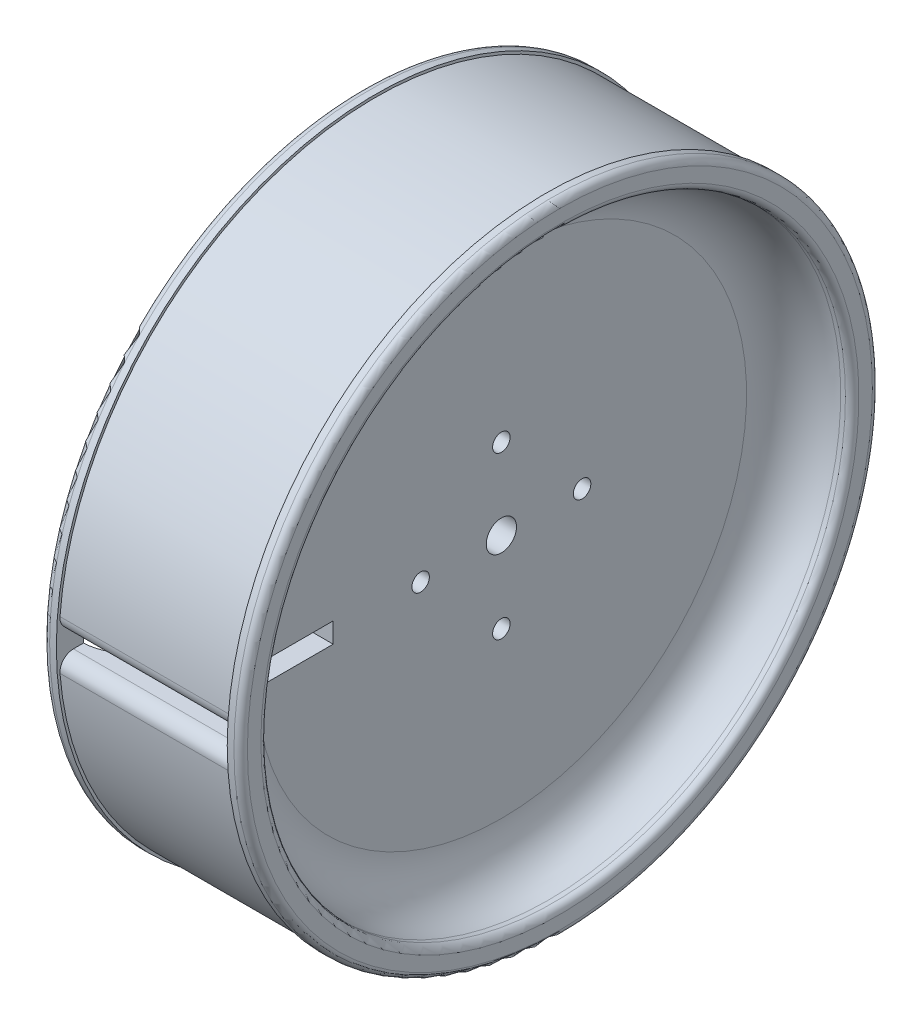
ISO-10303-21;
HEADER;
FILE_DESCRIPTION(('STEP AP214'),'2;1');
FILE_NAME('part.step','',(''),(''),'','','');
FILE_SCHEMA(('AUTOMOTIVE_DESIGN { 1 0 10303 214 1 1 1 1 }'));
ENDSEC;
DATA;
#1=APPLICATION_CONTEXT('core data for automotive mechanical design processes');
#2=APPLICATION_PROTOCOL_DEFINITION('international standard','automotive_design',2000,#1);
#3=PRODUCT_CONTEXT('',#1,'mechanical');
#4=PRODUCT('Part','Part','',(#3));
#5=PRODUCT_RELATED_PRODUCT_CATEGORY('part','',(#4));
#6=PRODUCT_DEFINITION_FORMATION('','',#4);
#7=PRODUCT_DEFINITION_CONTEXT('part definition',#1,'design');
#8=PRODUCT_DEFINITION('design','',#6,#7);
#9=PRODUCT_DEFINITION_SHAPE('','',#8);
#10=(LENGTH_UNIT() NAMED_UNIT(*) SI_UNIT(.MILLI.,.METRE.));
#11=(NAMED_UNIT(*) PLANE_ANGLE_UNIT() SI_UNIT($,.RADIAN.));
#12=(NAMED_UNIT(*) SI_UNIT($,.STERADIAN.) SOLID_ANGLE_UNIT());
#13=UNCERTAINTY_MEASURE_WITH_UNIT(LENGTH_MEASURE(1.E-05),#10,'distance_accuracy_value','');
#14=(GEOMETRIC_REPRESENTATION_CONTEXT(3) GLOBAL_UNCERTAINTY_ASSIGNED_CONTEXT((#13)) GLOBAL_UNIT_ASSIGNED_CONTEXT((#10,
#11,#12)) REPRESENTATION_CONTEXT('',''));
#15=CARTESIAN_POINT('',(0.,0.,0.));
#16=DIRECTION('',(0.,0.,1.));
#17=DIRECTION('',(1.,0.,0.));
#18=AXIS2_PLACEMENT_3D('',#15,#16,#17);
#19=CARTESIAN_POINT('',(6.,0.,0.));
#20=DIRECTION('',(-1.,0.,0.));
#21=DIRECTION('',(0.,0.,1.));
#22=AXIS2_PLACEMENT_3D('',#19,#20,#21);
#23=PLANE('',#22);
#24=CARTESIAN_POINT('',(6.,0.,0.));
#25=DIRECTION('',(1.,0.,0.));
#26=DIRECTION('',(0.,0.,-1.));
#27=AXIS2_PLACEMENT_3D('',#24,#25,#26);
#28=CIRCLE('',#27,2.25);
#29=CARTESIAN_POINT('',(6.,0.,-2.25));
#30=VERTEX_POINT('',#29);
#31=EDGE_CURVE('E218',#30,#30,#28,.T.);
#32=ORIENTED_EDGE('',*,*,#31,.F.);
#33=EDGE_LOOP('',(#32));
#34=FACE_BOUND('',#33,.T.);
#35=CARTESIAN_POINT('',(6.,0.,-12.));
#36=DIRECTION('',(1.,0.,0.));
#37=DIRECTION('',(0.,0.,-1.));
#38=AXIS2_PLACEMENT_3D('',#35,#36,#37);
#39=CIRCLE('',#38,1.3);
#40=CARTESIAN_POINT('',(6.,0.,-13.3));
#41=VERTEX_POINT('',#40);
#42=EDGE_CURVE('E198',#41,#41,#39,.T.);
#43=ORIENTED_EDGE('',*,*,#42,.F.);
#44=EDGE_LOOP('',(#43));
#45=FACE_BOUND('',#44,.T.);
#46=CARTESIAN_POINT('',(6.,-12.,0.));
#47=DIRECTION('',(1.,0.,0.));
#48=DIRECTION('',(0.,0.,-1.));
#49=AXIS2_PLACEMENT_3D('',#46,#47,#48);
#50=CIRCLE('',#49,1.3);
#51=CARTESIAN_POINT('',(6.,-12.,-1.3));
#52=VERTEX_POINT('',#51);
#53=EDGE_CURVE('E197',#52,#52,#50,.T.);
#54=ORIENTED_EDGE('',*,*,#53,.F.);
#55=EDGE_LOOP('',(#54));
#56=FACE_BOUND('',#55,.T.);
#57=CARTESIAN_POINT('',(6.,0.,12.));
#58=DIRECTION('',(1.,0.,0.));
#59=DIRECTION('',(0.,0.,-1.));
#60=AXIS2_PLACEMENT_3D('',#57,#58,#59);
#61=CIRCLE('',#60,1.3);
#62=CARTESIAN_POINT('',(6.,0.,10.7));
#63=VERTEX_POINT('',#62);
#64=EDGE_CURVE('E214',#63,#63,#61,.T.);
#65=ORIENTED_EDGE('',*,*,#64,.F.);
#66=EDGE_LOOP('',(#65));
#67=FACE_BOUND('',#66,.T.);
#68=CARTESIAN_POINT('',(6.,12.,0.));
#69=DIRECTION('',(1.,0.,0.));
#70=DIRECTION('',(0.,0.,-1.));
#71=AXIS2_PLACEMENT_3D('',#68,#69,#70);
#72=CIRCLE('',#71,1.3);
#73=CARTESIAN_POINT('',(6.,12.,-1.3));
#74=VERTEX_POINT('',#73);
#75=EDGE_CURVE('E213',#74,#74,#72,.T.);
#76=ORIENTED_EDGE('',*,*,#75,.F.);
#77=EDGE_LOOP('',(#76));
#78=FACE_BOUND('',#77,.T.);
#79=DIRECTION('',(0.,0.,-1.));
#80=VECTOR('',#79,1.);
#81=CARTESIAN_POINT('',(6.,-1.5,0.));
#82=LINE('',#81,#80);
#83=CARTESIAN_POINT('',(6.,-1.5,36.4191227241953));
#84=VERTEX_POINT('',#83);
#85=CARTESIAN_POINT('',(6.,-1.5,25.));
#86=VERTEX_POINT('',#85);
#87=EDGE_CURVE('E163',#84,#86,#82,.T.);
#88=ORIENTED_EDGE('',*,*,#87,.F.);
#89=CARTESIAN_POINT('',(6.,0.,0.));
#90=DIRECTION('',(-1.,0.,0.));
#91=DIRECTION('',(0.,0.,1.));
#92=AXIS2_PLACEMENT_3D('',#89,#90,#91);
#93=CIRCLE('',#92,36.45);
#94=CARTESIAN_POINT('',(6.,1.5,36.4191227241953));
#95=VERTEX_POINT('',#94);
#96=EDGE_CURVE('E315',#84,#95,#93,.F.);
#97=ORIENTED_EDGE('',*,*,#96,.T.);
#98=DIRECTION('',(0.,0.,1.));
#99=VECTOR('',#98,1.);
#100=CARTESIAN_POINT('',(6.,1.5,0.));
#101=LINE('',#100,#99);
#102=CARTESIAN_POINT('',(6.,1.5,25.));
#103=VERTEX_POINT('',#102);
#104=EDGE_CURVE('E172',#103,#95,#101,.T.);
#105=ORIENTED_EDGE('',*,*,#104,.F.);
#106=DIRECTION('',(0.,-1.,0.));
#107=VECTOR('',#106,1.);
#108=CARTESIAN_POINT('',(6.,0.,25.));
#109=LINE('',#108,#107);
#110=EDGE_CURVE('E189',#103,#86,#109,.T.);
#111=ORIENTED_EDGE('',*,*,#110,.T.);
#112=EDGE_LOOP('',(#88,#97,#105,#111));
#113=FACE_BOUND('',#112,.T.);
#114=ADVANCED_FACE('F47',(#34,#45,#56,#67,#78,#113),#23,.F.);
#115=CARTESIAN_POINT('',(-6.,0.,-43.45));
#116=DIRECTION('',(1.,0.,0.));
#117=DIRECTION('',(0.,0.,-1.));
#118=AXIS2_PLACEMENT_3D('',#115,#116,#117);
#119=PLANE('',#118);
#120=CARTESIAN_POINT('',(-6.,0.,0.));
#121=DIRECTION('',(1.,0.,0.));
#122=DIRECTION('',(0.,0.,-1.));
#123=AXIS2_PLACEMENT_3D('',#120,#121,#122);
#124=CIRCLE('',#123,2.25);
#125=CARTESIAN_POINT('',(-6.,0.,-2.25));
#126=VERTEX_POINT('',#125);
#127=EDGE_CURVE('E228',#126,#126,#124,.F.);
#128=ORIENTED_EDGE('',*,*,#127,.F.);
#129=EDGE_LOOP('',(#128));
#130=FACE_BOUND('',#129,.T.);
#131=CARTESIAN_POINT('',(-6.,0.,-12.));
#132=DIRECTION('',(1.,0.,0.));
#133=DIRECTION('',(0.,0.,-1.));
#134=AXIS2_PLACEMENT_3D('',#131,#132,#133);
#135=CIRCLE('',#134,1.3);
#136=CARTESIAN_POINT('',(-6.,0.,-13.3));
#137=VERTEX_POINT('',#136);
#138=EDGE_CURVE('E192',#137,#137,#135,.F.);
#139=ORIENTED_EDGE('',*,*,#138,.F.);
#140=EDGE_LOOP('',(#139));
#141=FACE_BOUND('',#140,.T.);
#142=CARTESIAN_POINT('',(-6.,-12.,0.));
#143=DIRECTION('',(1.,0.,0.));
#144=DIRECTION('',(0.,0.,-1.));
#145=AXIS2_PLACEMENT_3D('',#142,#143,#144);
#146=CIRCLE('',#145,1.3);
#147=CARTESIAN_POINT('',(-6.,-12.,-1.3));
#148=VERTEX_POINT('',#147);
#149=EDGE_CURVE('E193',#148,#148,#146,.F.);
#150=ORIENTED_EDGE('',*,*,#149,.F.);
#151=EDGE_LOOP('',(#150));
#152=FACE_BOUND('',#151,.T.);
#153=CARTESIAN_POINT('',(-6.,0.,12.));
#154=DIRECTION('',(1.,0.,0.));
#155=DIRECTION('',(0.,0.,-1.));
#156=AXIS2_PLACEMENT_3D('',#153,#154,#155);
#157=CIRCLE('',#156,1.3);
#158=CARTESIAN_POINT('',(-6.,0.,10.7));
#159=VERTEX_POINT('',#158);
#160=EDGE_CURVE('E202',#159,#159,#157,.F.);
#161=ORIENTED_EDGE('',*,*,#160,.F.);
#162=EDGE_LOOP('',(#161));
#163=FACE_BOUND('',#162,.T.);
#164=CARTESIAN_POINT('',(-6.,12.,0.));
#165=DIRECTION('',(1.,0.,0.));
#166=DIRECTION('',(0.,0.,-1.));
#167=AXIS2_PLACEMENT_3D('',#164,#165,#166);
#168=CIRCLE('',#167,1.3);
#169=CARTESIAN_POINT('',(-6.,12.,-1.3));
#170=VERTEX_POINT('',#169);
#171=EDGE_CURVE('E209',#170,#170,#168,.F.);
#172=ORIENTED_EDGE('',*,*,#171,.F.);
#173=EDGE_LOOP('',(#172));
#174=FACE_BOUND('',#173,.T.);
#175=DIRECTION('',(0.,0.,-1.));
#176=VECTOR('',#175,1.);
#177=CARTESIAN_POINT('',(-6.,1.5,-43.45));
#178=LINE('',#177,#176);
#179=CARTESIAN_POINT('',(-6.,1.5,36.4191227241953));
#180=VERTEX_POINT('',#179);
#181=CARTESIAN_POINT('',(-6.,1.5,25.));
#182=VERTEX_POINT('',#181);
#183=EDGE_CURVE('E177',#180,#182,#178,.T.);
#184=ORIENTED_EDGE('',*,*,#183,.F.);
#185=CARTESIAN_POINT('',(-6.,0.,0.));
#186=DIRECTION('',(1.,0.,0.));
#187=DIRECTION('',(0.,0.,-1.));
#188=AXIS2_PLACEMENT_3D('',#185,#186,#187);
#189=CIRCLE('',#188,36.45);
#190=CARTESIAN_POINT('',(-6.,-1.5,36.4191227241953));
#191=VERTEX_POINT('',#190);
#192=EDGE_CURVE('E170',#180,#191,#189,.F.);
#193=ORIENTED_EDGE('',*,*,#192,.T.);
#194=DIRECTION('',(0.,0.,1.));
#195=VECTOR('',#194,1.);
#196=CARTESIAN_POINT('',(-6.,-1.5,-43.45));
#197=LINE('',#196,#195);
#198=CARTESIAN_POINT('',(-6.,-1.5,25.));
#199=VERTEX_POINT('',#198);
#200=EDGE_CURVE('E161',#199,#191,#197,.T.);
#201=ORIENTED_EDGE('',*,*,#200,.F.);
#202=DIRECTION('',(0.,1.,0.));
#203=VECTOR('',#202,1.);
#204=CARTESIAN_POINT('',(-6.,0.,25.));
#205=LINE('',#204,#203);
#206=EDGE_CURVE('E143',#199,#182,#205,.T.);
#207=ORIENTED_EDGE('',*,*,#206,.T.);
#208=EDGE_LOOP('',(#184,#193,#201,#207));
#209=FACE_BOUND('',#208,.T.);
#210=ADVANCED_FACE('F168',(#130,#141,#152,#163,#174,#209),#119,.F.);
#211=CARTESIAN_POINT('',(-6.,0.,0.));
#212=DIRECTION('',(-1.,0.,0.));
#213=DIRECTION('',(0.,0.,1.));
#214=AXIS2_PLACEMENT_3D('',#211,#212,#213);
#215=CYLINDRICAL_SURFACE('',#214,43.45);
#216=CARTESIAN_POINT('',(-13.7,0.,0.));
#217=DIRECTION('',(1.,0.,0.));
#218=DIRECTION('',(0.,0.,-1.));
#219=AXIS2_PLACEMENT_3D('',#216,#217,#218);
#220=CIRCLE('',#219,43.45);
#221=CARTESIAN_POINT('',(-13.7,0.,-43.45));
#222=VERTEX_POINT('',#221);
#223=EDGE_CURVE('E262',#222,#222,#220,.F.);
#224=ORIENTED_EDGE('',*,*,#223,.T.);
#225=EDGE_LOOP('',(#224));
#226=FACE_BOUND('',#225,.T.);
#227=CARTESIAN_POINT('',(-12.7,0.,0.));
#228=DIRECTION('',(1.,0.,0.));
#229=DIRECTION('',(0.,0.,-1.));
#230=AXIS2_PLACEMENT_3D('',#227,#228,#229);
#231=CIRCLE('',#230,43.45);
#232=CARTESIAN_POINT('',(-12.7,-1.5,43.4241004512471));
#233=VERTEX_POINT('',#232);
#234=CARTESIAN_POINT('',(-12.7,1.5,43.4241004512471));
#235=VERTEX_POINT('',#234);
#236=EDGE_CURVE('E185',#233,#235,#231,.F.);
#237=ORIENTED_EDGE('',*,*,#236,.F.);
#238=DIRECTION('',(-1.,0.,0.));
#239=VECTOR('',#238,1.);
#240=CARTESIAN_POINT('',(-6.,-1.5,43.4241004512471));
#241=LINE('',#240,#239);
#242=CARTESIAN_POINT('',(-13.,-1.5,43.4241004512471));
#243=VERTEX_POINT('',#242);
#244=EDGE_CURVE('E295',#233,#243,#241,.T.);
#245=ORIENTED_EDGE('',*,*,#244,.T.);
#246=CARTESIAN_POINT('',(-13.,0.,0.));
#247=DIRECTION('',(1.,0.,0.));
#248=DIRECTION('',(0.,0.,-1.));
#249=AXIS2_PLACEMENT_3D('',#246,#247,#248);
#250=CIRCLE('',#249,43.45);
#251=CARTESIAN_POINT('',(-13.,1.7880658436214,43.4131929318597));
#252=VERTEX_POINT('',#251);
#253=EDGE_CURVE('E292',#243,#252,#250,.T.);
#254=ORIENTED_EDGE('',*,*,#253,.T.);
#255=CARTESIAN_POINT('',(-13.,0.,0.));
#256=DIRECTION('',(1.,0.,0.));
#257=DIRECTION('',(0.,0.,-1.));
#258=AXIS2_PLACEMENT_3D('',#255,#256,#257);
#259=CIRCLE('',#258,43.45);
#260=CARTESIAN_POINT('',(-13.,1.5,43.4241004512471));
#261=VERTEX_POINT('',#260);
#262=EDGE_CURVE('E288',#252,#261,#259,.T.);
#263=ORIENTED_EDGE('',*,*,#262,.T.);
#264=DIRECTION('',(-1.,0.,0.));
#265=VECTOR('',#264,1.);
#266=CARTESIAN_POINT('',(-6.,1.5,43.4241004512471));
#267=LINE('',#266,#265);
#268=EDGE_CURVE('E284',#261,#235,#267,.F.);
#269=ORIENTED_EDGE('',*,*,#268,.T.);
#270=EDGE_LOOP('',(#237,#245,#254,#263,#269));
#271=FACE_BOUND('',#270,.T.);
#272=ADVANCED_FACE('F378',(#226,#271),#215,.F.);
#273=CARTESIAN_POINT('',(-6.,0.,0.));
#274=DIRECTION('',(-1.,0.,0.));
#275=DIRECTION('',(0.,0.,1.));
#276=AXIS2_PLACEMENT_3D('',#273,#274,#275);
#277=CYLINDRICAL_SURFACE('',#276,47.05);
#278=CARTESIAN_POINT('',(12.7,0.,0.));
#279=DIRECTION('',(-1.,0.,0.));
#280=DIRECTION('',(0.,0.,1.));
#281=AXIS2_PLACEMENT_3D('',#278,#279,#280);
#282=CIRCLE('',#281,47.05);
#283=CARTESIAN_POINT('',(12.7,3.65538290788013,46.9077890738497));
#284=VERTEX_POINT('',#283);
#285=CARTESIAN_POINT('',(12.7,-3.65538290788013,46.9077890738497));
#286=VERTEX_POINT('',#285);
#287=EDGE_CURVE('E236',#284,#286,#282,.T.);
#288=ORIENTED_EDGE('',*,*,#287,.T.);
#289=DIRECTION('',(-1.,0.,0.));
#290=VECTOR('',#289,1.);
#291=CARTESIAN_POINT('',(-6.,-3.65538290788013,46.9077890738497));
#292=LINE('',#291,#290);
#293=CARTESIAN_POINT('',(-12.7,-3.65538290788013,46.9077890738497));
#294=VERTEX_POINT('',#293);
#295=EDGE_CURVE('E465',#286,#294,#292,.T.);
#296=ORIENTED_EDGE('',*,*,#295,.T.);
#297=CARTESIAN_POINT('',(-12.7,0.,0.));
#298=DIRECTION('',(-1.,0.,0.));
#299=DIRECTION('',(0.,0.,1.));
#300=AXIS2_PLACEMENT_3D('',#297,#298,#299);
#301=CIRCLE('',#300,47.05);
#302=CARTESIAN_POINT('',(-12.7,3.65538290788013,46.9077890738497));
#303=VERTEX_POINT('',#302);
#304=EDGE_CURVE('E240',#303,#294,#301,.T.);
#305=ORIENTED_EDGE('',*,*,#304,.F.);
#306=DIRECTION('',(-1.,0.,0.));
#307=VECTOR('',#306,1.);
#308=CARTESIAN_POINT('',(-6.,3.65538290788013,46.9077890738497));
#309=LINE('',#308,#307);
#310=EDGE_CURVE('E463',#303,#284,#309,.F.);
#311=ORIENTED_EDGE('',*,*,#310,.T.);
#312=EDGE_LOOP('',(#288,#296,#305,#311));
#313=FACE_BOUND('',#312,.T.);
#314=ADVANCED_FACE('F425',(#313),#277,.T.);
#315=CARTESIAN_POINT('',(-6.,0.,0.));
#316=DIRECTION('',(-1.,0.,0.));
#317=DIRECTION('',(0.,0.,1.));
#318=AXIS2_PLACEMENT_3D('',#315,#316,#317);
#319=CYLINDRICAL_SURFACE('',#318,43.45);
#320=CARTESIAN_POINT('',(13.7,0.,0.));
#321=DIRECTION('',(-1.,0.,0.));
#322=DIRECTION('',(0.,0.,1.));
#323=AXIS2_PLACEMENT_3D('',#320,#321,#322);
#324=CIRCLE('',#323,43.45);
#325=CARTESIAN_POINT('',(13.7,0.,43.45));
#326=VERTEX_POINT('',#325);
#327=EDGE_CURVE('E274',#326,#326,#324,.F.);
#328=ORIENTED_EDGE('',*,*,#327,.T.);
#329=EDGE_LOOP('',(#328));
#330=FACE_BOUND('',#329,.T.);
#331=CARTESIAN_POINT('',(13.,0.,0.));
#332=DIRECTION('',(-1.,0.,0.));
#333=DIRECTION('',(0.,0.,1.));
#334=AXIS2_PLACEMENT_3D('',#331,#332,#333);
#335=CIRCLE('',#334,43.45);
#336=CARTESIAN_POINT('',(13.,1.78806584362144,43.4131929318597));
#337=VERTEX_POINT('',#336);
#338=CARTESIAN_POINT('',(13.,-1.5,43.4241004512471));
#339=VERTEX_POINT('',#338);
#340=EDGE_CURVE('E307',#337,#339,#335,.T.);
#341=ORIENTED_EDGE('',*,*,#340,.T.);
#342=DIRECTION('',(-1.,0.,0.));
#343=VECTOR('',#342,1.);
#344=CARTESIAN_POINT('',(-6.,-1.5,43.4241004512471));
#345=LINE('',#344,#343);
#346=CARTESIAN_POINT('',(12.7,-1.5,43.4241004512471));
#347=VERTEX_POINT('',#346);
#348=EDGE_CURVE('E311',#339,#347,#345,.T.);
#349=ORIENTED_EDGE('',*,*,#348,.T.);
#350=CARTESIAN_POINT('',(12.7,0.,0.));
#351=DIRECTION('',(-1.,0.,0.));
#352=DIRECTION('',(0.,0.,1.));
#353=AXIS2_PLACEMENT_3D('',#350,#351,#352);
#354=CIRCLE('',#353,43.45);
#355=CARTESIAN_POINT('',(12.7,1.5,43.4241004512471));
#356=VERTEX_POINT('',#355);
#357=EDGE_CURVE('E155',#356,#347,#354,.F.);
#358=ORIENTED_EDGE('',*,*,#357,.F.);
#359=DIRECTION('',(-1.,0.,0.));
#360=VECTOR('',#359,1.);
#361=CARTESIAN_POINT('',(-6.,1.5,43.4241004512471));
#362=LINE('',#361,#360);
#363=CARTESIAN_POINT('',(13.,1.5,43.4241004512471));
#364=VERTEX_POINT('',#363);
#365=EDGE_CURVE('E299',#356,#364,#362,.F.);
#366=ORIENTED_EDGE('',*,*,#365,.T.);
#367=CARTESIAN_POINT('',(13.,0.,0.));
#368=DIRECTION('',(-1.,0.,0.));
#369=DIRECTION('',(0.,0.,1.));
#370=AXIS2_PLACEMENT_3D('',#367,#368,#369);
#371=CIRCLE('',#370,43.45);
#372=EDGE_CURVE('E303',#364,#337,#371,.T.);
#373=ORIENTED_EDGE('',*,*,#372,.T.);
#374=EDGE_LOOP('',(#341,#349,#358,#366,#373));
#375=FACE_BOUND('',#374,.T.);
#376=ADVANCED_FACE('F427',(#330,#375),#319,.F.);
#377=CARTESIAN_POINT('',(-14.7,0.,-47.45));
#378=DIRECTION('',(1.,0.,0.));
#379=DIRECTION('',(0.,0.,-1.));
#380=AXIS2_PLACEMENT_3D('',#377,#378,#379);
#381=PLANE('',#380);
#382=CARTESIAN_POINT('',(-14.7,0.,0.));
#383=DIRECTION('',(1.,0.,0.));
#384=DIRECTION('',(0.,0.,-1.));
#385=AXIS2_PLACEMENT_3D('',#382,#383,#384);
#386=CIRCLE('',#385,46.45);
#387=CARTESIAN_POINT('',(-14.7,0.,-46.45));
#388=VERTEX_POINT('',#387);
#389=EDGE_CURVE('E254',#388,#388,#386,.F.);
#390=ORIENTED_EDGE('',*,*,#389,.T.);
#391=EDGE_LOOP('',(#390));
#392=FACE_BOUND('',#391,.T.);
#393=CARTESIAN_POINT('',(-14.7,0.,0.));
#394=DIRECTION('',(1.,0.,0.));
#395=DIRECTION('',(0.,0.,-1.));
#396=AXIS2_PLACEMENT_3D('',#393,#394,#395);
#397=CIRCLE('',#396,44.45);
#398=CARTESIAN_POINT('',(-14.7,0.,-44.45));
#399=VERTEX_POINT('',#398);
#400=EDGE_CURVE('E154',#399,#399,#397,.T.);
#401=ORIENTED_EDGE('',*,*,#400,.T.);
#402=EDGE_LOOP('',(#401));
#403=FACE_BOUND('',#402,.T.);
#404=ADVANCED_FACE('F432',(#392,#403),#381,.F.);
#405=CARTESIAN_POINT('',(-6.,0.,0.));
#406=DIRECTION('',(-1.,0.,0.));
#407=DIRECTION('',(0.,0.,1.));
#408=AXIS2_PLACEMENT_3D('',#405,#406,#407);
#409=CYLINDRICAL_SURFACE('',#408,47.45);
#410=CARTESIAN_POINT('',(-13.7,0.,0.));
#411=DIRECTION('',(1.,0.,0.));
#412=DIRECTION('',(0.,0.,-1.));
#413=AXIS2_PLACEMENT_3D('',#410,#411,#412);
#414=CIRCLE('',#413,47.45);
#415=CARTESIAN_POINT('',(-13.7,0.,-47.45));
#416=VERTEX_POINT('',#415);
#417=EDGE_CURVE('E258',#416,#416,#414,.T.);
#418=ORIENTED_EDGE('',*,*,#417,.T.);
#419=EDGE_LOOP('',(#418));
#420=FACE_BOUND('',#419,.T.);
#421=CARTESIAN_POINT('',(-12.7,0.,0.));
#422=DIRECTION('',(-1.,0.,0.));
#423=DIRECTION('',(0.,0.,1.));
#424=AXIS2_PLACEMENT_3D('',#421,#422,#423);
#425=CIRCLE('',#424,47.45);
#426=CARTESIAN_POINT('',(-12.7,0.,47.45));
#427=VERTEX_POINT('',#426);
#428=EDGE_CURVE('E244',#427,#427,#425,.T.);
#429=ORIENTED_EDGE('',*,*,#428,.T.);
#430=EDGE_LOOP('',(#429));
#431=FACE_BOUND('',#430,.T.);
#432=ADVANCED_FACE('F420',(#420,#431),#409,.T.);
#433=CARTESIAN_POINT('',(-12.7,0.,-47.45));
#434=DIRECTION('',(-1.,0.,0.));
#435=DIRECTION('',(0.,0.,1.));
#436=AXIS2_PLACEMENT_3D('',#433,#434,#435);
#437=PLANE('',#436);
#438=ORIENTED_EDGE('',*,*,#428,.F.);
#439=EDGE_LOOP('',(#438));
#440=FACE_BOUND('',#439,.T.);
#441=DIRECTION('',(0.,0.,-1.));
#442=VECTOR('',#441,1.);
#443=CARTESIAN_POINT('',(-12.7,1.5,47.45));
#444=LINE('',#443,#442);
#445=CARTESIAN_POINT('',(-12.7,1.5,44.913834171667));
#446=VERTEX_POINT('',#445);
#447=EDGE_CURVE('E448',#446,#235,#444,.T.);
#448=ORIENTED_EDGE('',*,*,#447,.F.);
#449=CARTESIAN_POINT('',(-12.7,3.5,44.913834171667));
#450=DIRECTION('',(-1.,0.,0.));
#451=DIRECTION('',(0.,0.,1.));
#452=AXIS2_PLACEMENT_3D('',#449,#450,#451);
#453=CIRCLE('',#452,2.);
#454=EDGE_CURVE('E56',#446,#303,#453,.T.);
#455=ORIENTED_EDGE('',*,*,#454,.T.);
#456=ORIENTED_EDGE('',*,*,#304,.T.);
#457=CARTESIAN_POINT('',(-12.7,-3.5,44.913834171667));
#458=DIRECTION('',(-1.,0.,0.));
#459=DIRECTION('',(0.,0.,1.));
#460=AXIS2_PLACEMENT_3D('',#457,#458,#459);
#461=CIRCLE('',#460,2.);
#462=CARTESIAN_POINT('',(-12.7,-1.5,44.913834171667));
#463=VERTEX_POINT('',#462);
#464=EDGE_CURVE('E450',#294,#463,#461,.T.);
#465=ORIENTED_EDGE('',*,*,#464,.T.);
#466=DIRECTION('',(0.,0.,-1.));
#467=VECTOR('',#466,1.);
#468=CARTESIAN_POINT('',(-12.7,-1.5,47.45));
#469=LINE('',#468,#467);
#470=EDGE_CURVE('E449',#463,#233,#469,.T.);
#471=ORIENTED_EDGE('',*,*,#470,.T.);
#472=ORIENTED_EDGE('',*,*,#236,.T.);
#473=EDGE_LOOP('',(#448,#455,#456,#465,#471,#472));
#474=FACE_BOUND('',#473,.T.);
#475=ADVANCED_FACE('F414',(#440,#474),#437,.F.);
#476=CARTESIAN_POINT('',(12.7,0.,-47.45));
#477=DIRECTION('',(1.,0.,0.));
#478=DIRECTION('',(0.,0.,-1.));
#479=AXIS2_PLACEMENT_3D('',#476,#477,#478);
#480=PLANE('',#479);
#481=ORIENTED_EDGE('',*,*,#287,.F.);
#482=CARTESIAN_POINT('',(12.7,3.5,44.913834171667));
#483=DIRECTION('',(1.,0.,0.));
#484=DIRECTION('',(0.,0.,-1.));
#485=AXIS2_PLACEMENT_3D('',#482,#483,#484);
#486=CIRCLE('',#485,2.);
#487=CARTESIAN_POINT('',(12.7,1.5,44.913834171667));
#488=VERTEX_POINT('',#487);
#489=EDGE_CURVE('E11',#284,#488,#486,.T.);
#490=ORIENTED_EDGE('',*,*,#489,.T.);
#491=DIRECTION('',(0.,0.,-1.));
#492=VECTOR('',#491,1.);
#493=CARTESIAN_POINT('',(12.7,1.5,47.45));
#494=LINE('',#493,#492);
#495=EDGE_CURVE('E179',#488,#356,#494,.T.);
#496=ORIENTED_EDGE('',*,*,#495,.T.);
#497=ORIENTED_EDGE('',*,*,#357,.T.);
#498=DIRECTION('',(0.,0.,-1.));
#499=VECTOR('',#498,1.);
#500=CARTESIAN_POINT('',(12.7,-1.5,47.45));
#501=LINE('',#500,#499);
#502=CARTESIAN_POINT('',(12.7,-1.5,44.913834171667));
#503=VERTEX_POINT('',#502);
#504=EDGE_CURVE('E165',#503,#347,#501,.T.);
#505=ORIENTED_EDGE('',*,*,#504,.F.);
#506=CARTESIAN_POINT('',(12.7,-3.5,44.913834171667));
#507=DIRECTION('',(1.,0.,0.));
#508=DIRECTION('',(0.,0.,-1.));
#509=AXIS2_PLACEMENT_3D('',#506,#507,#508);
#510=CIRCLE('',#509,2.);
#511=EDGE_CURVE('E471',#503,#286,#510,.T.);
#512=ORIENTED_EDGE('',*,*,#511,.T.);
#513=EDGE_LOOP('',(#481,#490,#496,#497,#505,#512));
#514=FACE_BOUND('',#513,.T.);
#515=CARTESIAN_POINT('',(12.7,0.,0.));
#516=DIRECTION('',(-1.,0.,0.));
#517=DIRECTION('',(0.,0.,1.));
#518=AXIS2_PLACEMENT_3D('',#515,#516,#517);
#519=CIRCLE('',#518,47.45);
#520=CARTESIAN_POINT('',(12.7,0.,47.45));
#521=VERTEX_POINT('',#520);
#522=EDGE_CURVE('E232',#521,#521,#519,.T.);
#523=ORIENTED_EDGE('',*,*,#522,.T.);
#524=EDGE_LOOP('',(#523));
#525=FACE_BOUND('',#524,.T.);
#526=ADVANCED_FACE('F409',(#514,#525),#480,.F.);
#527=CARTESIAN_POINT('',(-6.,0.,0.));
#528=DIRECTION('',(-1.,0.,0.));
#529=DIRECTION('',(0.,0.,1.));
#530=AXIS2_PLACEMENT_3D('',#527,#528,#529);
#531=CYLINDRICAL_SURFACE('',#530,47.45);
#532=CARTESIAN_POINT('',(13.7,0.,0.));
#533=DIRECTION('',(-1.,0.,0.));
#534=DIRECTION('',(0.,0.,1.));
#535=AXIS2_PLACEMENT_3D('',#532,#533,#534);
#536=CIRCLE('',#535,47.45);
#537=CARTESIAN_POINT('',(13.7,0.,47.45));
#538=VERTEX_POINT('',#537);
#539=EDGE_CURVE('E278',#538,#538,#536,.T.);
#540=ORIENTED_EDGE('',*,*,#539,.T.);
#541=EDGE_LOOP('',(#540));
#542=FACE_BOUND('',#541,.T.);
#543=ORIENTED_EDGE('',*,*,#522,.F.);
#544=EDGE_LOOP('',(#543));
#545=FACE_BOUND('',#544,.T.);
#546=ADVANCED_FACE('F405',(#542,#545),#531,.T.);
#547=CARTESIAN_POINT('',(14.7,0.,-43.45));
#548=DIRECTION('',(-1.,0.,0.));
#549=DIRECTION('',(0.,0.,1.));
#550=AXIS2_PLACEMENT_3D('',#547,#548,#549);
#551=PLANE('',#550);
#552=CARTESIAN_POINT('',(14.7,0.,0.));
#553=DIRECTION('',(-1.,0.,0.));
#554=DIRECTION('',(0.,0.,1.));
#555=AXIS2_PLACEMENT_3D('',#552,#553,#554);
#556=CIRCLE('',#555,44.45);
#557=CARTESIAN_POINT('',(14.7,0.,44.45));
#558=VERTEX_POINT('',#557);
#559=EDGE_CURVE('E270',#558,#558,#556,.T.);
#560=ORIENTED_EDGE('',*,*,#559,.T.);
#561=EDGE_LOOP('',(#560));
#562=FACE_BOUND('',#561,.T.);
#563=CARTESIAN_POINT('',(14.7,0.,0.));
#564=DIRECTION('',(-1.,0.,0.));
#565=DIRECTION('',(0.,0.,1.));
#566=AXIS2_PLACEMENT_3D('',#563,#564,#565);
#567=CIRCLE('',#566,46.45);
#568=CARTESIAN_POINT('',(14.7,0.,46.45));
#569=VERTEX_POINT('',#568);
#570=EDGE_CURVE('E266',#569,#569,#567,.F.);
#571=ORIENTED_EDGE('',*,*,#570,.T.);
#572=EDGE_LOOP('',(#571));
#573=FACE_BOUND('',#572,.T.);
#574=ADVANCED_FACE('F408',(#562,#573),#551,.F.);
#575=CARTESIAN_POINT('',(-14.701,0.,0.));
#576=DIRECTION('',(1.,0.,0.));
#577=DIRECTION('',(0.,0.,-1.));
#578=AXIS2_PLACEMENT_3D('',#575,#576,#577);
#579=CYLINDRICAL_SURFACE('',#578,2.25);
#580=ORIENTED_EDGE('',*,*,#31,.T.);
#581=EDGE_LOOP('',(#580));
#582=FACE_BOUND('',#581,.T.);
#583=ORIENTED_EDGE('',*,*,#127,.T.);
#584=EDGE_LOOP('',(#583));
#585=FACE_BOUND('',#584,.T.);
#586=ADVANCED_FACE('F501',(#582,#585),#579,.F.);
#587=CARTESIAN_POINT('',(-14.701,0.,-12.));
#588=DIRECTION('',(1.,0.,0.));
#589=DIRECTION('',(0.,0.,-1.));
#590=AXIS2_PLACEMENT_3D('',#587,#588,#589);
#591=CYLINDRICAL_SURFACE('',#590,1.3);
#592=ORIENTED_EDGE('',*,*,#42,.T.);
#593=EDGE_LOOP('',(#592));
#594=FACE_BOUND('',#593,.T.);
#595=ORIENTED_EDGE('',*,*,#138,.T.);
#596=EDGE_LOOP('',(#595));
#597=FACE_BOUND('',#596,.T.);
#598=ADVANCED_FACE('F508',(#594,#597),#591,.F.);
#599=CARTESIAN_POINT('',(-14.701,-12.,0.));
#600=DIRECTION('',(1.,0.,0.));
#601=DIRECTION('',(0.,0.,-1.));
#602=AXIS2_PLACEMENT_3D('',#599,#600,#601);
#603=CYLINDRICAL_SURFACE('',#602,1.3);
#604=ORIENTED_EDGE('',*,*,#53,.T.);
#605=EDGE_LOOP('',(#604));
#606=FACE_BOUND('',#605,.T.);
#607=ORIENTED_EDGE('',*,*,#149,.T.);
#608=EDGE_LOOP('',(#607));
#609=FACE_BOUND('',#608,.T.);
#610=ADVANCED_FACE('F516',(#606,#609),#603,.F.);
#611=CARTESIAN_POINT('',(-14.701,0.,12.));
#612=DIRECTION('',(1.,0.,0.));
#613=DIRECTION('',(0.,0.,-1.));
#614=AXIS2_PLACEMENT_3D('',#611,#612,#613);
#615=CYLINDRICAL_SURFACE('',#614,1.3);
#616=ORIENTED_EDGE('',*,*,#64,.T.);
#617=EDGE_LOOP('',(#616));
#618=FACE_BOUND('',#617,.T.);
#619=ORIENTED_EDGE('',*,*,#160,.T.);
#620=EDGE_LOOP('',(#619));
#621=FACE_BOUND('',#620,.T.);
#622=ADVANCED_FACE('F532',(#618,#621),#615,.F.);
#623=CARTESIAN_POINT('',(-14.701,12.,0.));
#624=DIRECTION('',(1.,0.,0.));
#625=DIRECTION('',(0.,0.,-1.));
#626=AXIS2_PLACEMENT_3D('',#623,#624,#625);
#627=CYLINDRICAL_SURFACE('',#626,1.3);
#628=ORIENTED_EDGE('',*,*,#75,.T.);
#629=EDGE_LOOP('',(#628));
#630=FACE_BOUND('',#629,.T.);
#631=ORIENTED_EDGE('',*,*,#171,.T.);
#632=EDGE_LOOP('',(#631));
#633=FACE_BOUND('',#632,.T.);
#634=ADVANCED_FACE('F530',(#630,#633),#627,.F.);
#635=CARTESIAN_POINT('',(0.,0.,25.));
#636=DIRECTION('',(0.,0.,-1.));
#637=DIRECTION('',(-1.,0.,0.));
#638=AXIS2_PLACEMENT_3D('',#635,#636,#637);
#639=PLANE('',#638);
#640=DIRECTION('',(-1.,0.,0.));
#641=VECTOR('',#640,1.);
#642=CARTESIAN_POINT('',(-12.7,1.5,25.));
#643=LINE('',#642,#641);
#644=EDGE_CURVE('E149',#103,#182,#643,.T.);
#645=ORIENTED_EDGE('',*,*,#644,.T.);
#646=ORIENTED_EDGE('',*,*,#206,.F.);
#647=DIRECTION('',(1.,0.,0.));
#648=VECTOR('',#647,1.);
#649=CARTESIAN_POINT('',(-12.7,-1.5,25.));
#650=LINE('',#649,#648);
#651=EDGE_CURVE('E146',#199,#86,#650,.T.);
#652=ORIENTED_EDGE('',*,*,#651,.T.);
#653=ORIENTED_EDGE('',*,*,#110,.F.);
#654=EDGE_LOOP('',(#645,#646,#652,#653));
#655=FACE_BOUND('',#654,.T.);
#656=ADVANCED_FACE('F145',(#655),#639,.F.);
#657=CARTESIAN_POINT('',(-12.7,1.5,47.45));
#658=DIRECTION('',(0.,-1.,0.));
#659=DIRECTION('',(0.,0.,-1.));
#660=AXIS2_PLACEMENT_3D('',#657,#658,#659);
#661=PLANE('',#660);
#662=ORIENTED_EDGE('',*,*,#495,.F.);
#663=DIRECTION('',(1.,0.,0.));
#664=VECTOR('',#663,1.);
#665=CARTESIAN_POINT('',(-12.7,1.5,44.913834171667));
#666=LINE('',#665,#664);
#667=EDGE_CURVE('E468',#488,#446,#666,.F.);
#668=ORIENTED_EDGE('',*,*,#667,.T.);
#669=ORIENTED_EDGE('',*,*,#447,.T.);
#670=ORIENTED_EDGE('',*,*,#268,.F.);
#671=CARTESIAN_POINT('',(-6.,1.5,36.4191227241953));
#672=CARTESIAN_POINT('',(-5.99997889043218,1.5,36.6162614587659));
#673=CARTESIAN_POINT('',(-6.00831294403508,1.5,36.8133973322009));
#674=CARTESIAN_POINT('',(-6.04154039287624,1.5,37.2062600298996));
#675=CARTESIAN_POINT('',(-6.06643303931132,1.5,37.401986917475));
#676=CARTESIAN_POINT('',(-6.13260105480985,1.5,37.7904957357225));
#677=CARTESIAN_POINT('',(-6.17386370757436,1.5,37.9832798319398));
#678=CARTESIAN_POINT('',(-6.2724739861343,1.5,38.36468662013));
#679=CARTESIAN_POINT('',(-6.32982140447638,1.5,38.55330936574));
#680=CARTESIAN_POINT('',(-6.46021861582475,1.5,38.9251128381412));
#681=CARTESIAN_POINT('',(-6.53327328140785,1.5,39.1082918561066));
#682=CARTESIAN_POINT('',(-6.69458703188489,1.5,39.4679096566204));
#683=CARTESIAN_POINT('',(-6.78285172884166,1.5,39.6443459218252));
#684=CARTESIAN_POINT('',(-6.97389379218838,1.5,39.9890635306224));
#685=CARTESIAN_POINT('',(-7.07666392693893,1.5,40.1573488820119));
#686=CARTESIAN_POINT('',(-7.29606244674333,1.5,40.484721055295));
#687=CARTESIAN_POINT('',(-7.41269600155204,1.5,40.6438044126252));
#688=CARTESIAN_POINT('',(-7.65886161040407,1.5,40.951443762591));
#689=CARTESIAN_POINT('',(-7.78838305347778,1.5,41.1000082460097));
#690=CARTESIAN_POINT('',(-8.05954631291063,1.5,41.3857589501577));
#691=CARTESIAN_POINT('',(-8.20119359747876,1.5,41.5229399819622));
#692=CARTESIAN_POINT('',(-8.49555090829839,1.5,41.7848694799078));
#693=CARTESIAN_POINT('',(-8.64826092324111,1.5,41.9096179587577));
#694=CARTESIAN_POINT('',(-8.96358586511265,1.5,42.1457382408573));
#695=CARTESIAN_POINT('',(-9.12619626339907,1.5,42.2571160918494));
#696=CARTESIAN_POINT('',(-9.46017389554163,1.5,42.4657321511437));
#697=CARTESIAN_POINT('',(-9.63153826799456,1.5,42.5629749402972));
#698=CARTESIAN_POINT('',(-9.98178804429765,1.5,42.7426364158644));
#699=CARTESIAN_POINT('',(-10.1606706029681,1.5,42.8250606489816));
#700=CARTESIAN_POINT('',(-10.5248337181586,1.5,42.974578308733));
#701=CARTESIAN_POINT('',(-10.7101173400569,1.5,43.0416642695772));
#702=CARTESIAN_POINT('',(-11.0856116522023,1.5,43.1599532307373));
#703=CARTESIAN_POINT('',(-11.2758204930512,1.5,43.2111621017461));
#704=CARTESIAN_POINT('',(-11.6597208500043,1.5,43.2973293977937));
#705=CARTESIAN_POINT('',(-11.8534093977475,1.5,43.3323010484431));
#706=CARTESIAN_POINT('',(-12.2430461160169,1.5,43.3858084366049));
#707=CARTESIAN_POINT('',(-12.4389943128998,1.5,43.404343982208));
#708=CARTESIAN_POINT('',(-12.8319149016037,1.5,43.4248479337956));
#709=CARTESIAN_POINT('',(-13.0288879956628,1.5,43.4268028799998));
#710=CARTESIAN_POINT('',(-13.4223085341158,1.5,43.4141211420348));
#711=CARTESIAN_POINT('',(-13.6187559522794,1.5,43.3994836448572));
#712=CARTESIAN_POINT('',(-13.8142348542807,1.5,43.3765552044831));
#713=B_SPLINE_CURVE_WITH_KNOTS('',3,(#671,#672,#673,#674,#675,#676,#677,#678,#679,#680,#681,
#682,#683,#684,#685,#686,#687,#688,#689,#690,#691,#692,#693,#694,#695,#696,#697,#698,#699,#700,
#701,#702,#703,#704,#705,#706,#707,#708,#709,#710,#711,#712),.UNSPECIFIED.,.F.,.F.,(4,2,2,2,2,2,
2,2,2,2,2,2,2,2,2,2,2,2,2,2,4),(0.,0.591236105086431,1.18244547545085,1.77319648798156,
2.36393988164816,2.95486679609811,3.54601221421751,4.13686395288835,4.72793671917023,
5.3185268027986,5.90938463328574,6.50024185978245,7.0908308173095,7.68122794964911,
8.27140362943881,8.86186596418154,9.45210970921721,10.0418718392906,10.6316408553833,
11.2218885877254,11.8121652426975),.UNSPECIFIED.);
#714=EDGE_CURVE('E327',#261,#180,#713,.F.);
#715=ORIENTED_EDGE('',*,*,#714,.T.);
#716=ORIENTED_EDGE('',*,*,#183,.T.);
#717=ORIENTED_EDGE('',*,*,#644,.F.);
#718=ORIENTED_EDGE('',*,*,#104,.T.);
#719=CARTESIAN_POINT('',(6.,1.5,36.4191227241953));
#720=CARTESIAN_POINT('',(5.99997889043218,1.5,36.6162614587659));
#721=CARTESIAN_POINT('',(6.00831294403508,1.5,36.8133973322009));
#722=CARTESIAN_POINT('',(6.04154039287624,1.5,37.2062600298996));
#723=CARTESIAN_POINT('',(6.06643303931132,1.5,37.401986917475));
#724=CARTESIAN_POINT('',(6.13260105480985,1.5,37.7904957357225));
#725=CARTESIAN_POINT('',(6.17386370757436,1.5,37.9832798319398));
#726=CARTESIAN_POINT('',(6.2724739861343,1.5,38.36468662013));
#727=CARTESIAN_POINT('',(6.32982140447638,1.5,38.55330936574));
#728=CARTESIAN_POINT('',(6.46021861582475,1.5,38.9251128381412));
#729=CARTESIAN_POINT('',(6.53327328140785,1.5,39.1082918561066));
#730=CARTESIAN_POINT('',(6.69458703188489,1.5,39.4679096566204));
#731=CARTESIAN_POINT('',(6.78285172884166,1.5,39.6443459218252));
#732=CARTESIAN_POINT('',(6.97389379218838,1.5,39.9890635306224));
#733=CARTESIAN_POINT('',(7.07666392693893,1.5,40.1573488820119));
#734=CARTESIAN_POINT('',(7.29606244674333,1.5,40.484721055295));
#735=CARTESIAN_POINT('',(7.41269600155204,1.5,40.6438044126252));
#736=CARTESIAN_POINT('',(7.65886161040407,1.5,40.951443762591));
#737=CARTESIAN_POINT('',(7.78838305347778,1.5,41.1000082460097));
#738=CARTESIAN_POINT('',(8.05954631291063,1.5,41.3857589501577));
#739=CARTESIAN_POINT('',(8.20119359747877,1.5,41.5229399819622));
#740=CARTESIAN_POINT('',(8.49555090829839,1.5,41.7848694799078));
#741=CARTESIAN_POINT('',(8.64826092324111,1.5,41.9096179587577));
#742=CARTESIAN_POINT('',(8.96358586511265,1.5,42.1457382408573));
#743=CARTESIAN_POINT('',(9.12619626339907,1.5,42.2571160918494));
#744=CARTESIAN_POINT('',(9.46017389554163,1.5,42.4657321511437));
#745=CARTESIAN_POINT('',(9.63153826799456,1.5,42.5629749402972));
#746=CARTESIAN_POINT('',(9.98178804429765,1.5,42.7426364158644));
#747=CARTESIAN_POINT('',(10.1606706029681,1.5,42.8250606489816));
#748=CARTESIAN_POINT('',(10.5248337181586,1.5,42.974578308733));
#749=CARTESIAN_POINT('',(10.7101173400569,1.5,43.0416642695772));
#750=CARTESIAN_POINT('',(11.0856116522023,1.5,43.1599532307373));
#751=CARTESIAN_POINT('',(11.2758204930512,1.5,43.2111621017461));
#752=CARTESIAN_POINT('',(11.6597208500043,1.5,43.2973293977937));
#753=CARTESIAN_POINT('',(11.8534093977475,1.5,43.3323010484431));
#754=CARTESIAN_POINT('',(12.2430461160169,1.5,43.3858084366049));
#755=CARTESIAN_POINT('',(12.4389943128998,1.5,43.404343982208));
#756=CARTESIAN_POINT('',(12.8319149016037,1.5,43.4248479337956));
#757=CARTESIAN_POINT('',(13.0288879956628,1.5,43.4268028799998));
#758=CARTESIAN_POINT('',(13.4223085341158,1.5,43.4141211420348));
#759=CARTESIAN_POINT('',(13.6187559522794,1.5,43.3994836448572));
#760=CARTESIAN_POINT('',(13.8142348542807,1.5,43.3765552044831));
#761=B_SPLINE_CURVE_WITH_KNOTS('',3,(#719,#720,#721,#722,#723,#724,#725,#726,#727,#728,#729,
#730,#731,#732,#733,#734,#735,#736,#737,#738,#739,#740,#741,#742,#743,#744,#745,#746,#747,#748,
#749,#750,#751,#752,#753,#754,#755,#756,#757,#758,#759,#760),.UNSPECIFIED.,.F.,.F.,(4,2,2,2,2,2,
2,2,2,2,2,2,2,2,2,2,2,2,2,2,4),(0.,0.591236105086431,1.18244547545085,1.77319648798156,
2.36393988164816,2.95486679609811,3.54601221421751,4.13686395288835,4.72793671917023,
5.31852680279861,5.90938463328575,6.50024185978245,7.0908308173095,7.68122794964911,
8.27140362943881,8.86186596418154,9.45210970921721,10.0418718392906,10.6316408553833,
11.2218885877254,11.8121652426975),.UNSPECIFIED.);
#762=EDGE_CURVE('E353',#95,#364,#761,.T.);
#763=ORIENTED_EDGE('',*,*,#762,.T.);
#764=ORIENTED_EDGE('',*,*,#365,.F.);
#765=EDGE_LOOP('',(#662,#668,#669,#670,#715,#716,#717,#718,#763,#764));
#766=FACE_BOUND('',#765,.T.);
#767=ADVANCED_FACE('F342',(#766),#661,.T.);
#768=CARTESIAN_POINT('',(-12.7,-1.5,47.45));
#769=DIRECTION('',(0.,1.,0.));
#770=DIRECTION('',(0.,0.,1.));
#771=AXIS2_PLACEMENT_3D('',#768,#769,#770);
#772=PLANE('',#771);
#773=ORIENTED_EDGE('',*,*,#470,.F.);
#774=DIRECTION('',(1.,0.,0.));
#775=VECTOR('',#774,1.);
#776=CARTESIAN_POINT('',(12.7,-1.5,44.913834171667));
#777=LINE('',#776,#775);
#778=EDGE_CURVE('E461',#463,#503,#777,.T.);
#779=ORIENTED_EDGE('',*,*,#778,.T.);
#780=ORIENTED_EDGE('',*,*,#504,.T.);
#781=ORIENTED_EDGE('',*,*,#348,.F.);
#782=CARTESIAN_POINT('',(6.,-1.5,36.4191227241953));
#783=CARTESIAN_POINT('',(5.99997889043218,-1.5,36.6162614587659));
#784=CARTESIAN_POINT('',(6.00831294403508,-1.5,36.8133973322009));
#785=CARTESIAN_POINT('',(6.04154039287624,-1.5,37.2062600298996));
#786=CARTESIAN_POINT('',(6.06643303931132,-1.5,37.401986917475));
#787=CARTESIAN_POINT('',(6.13260105480985,-1.5,37.7904957357225));
#788=CARTESIAN_POINT('',(6.17386370757436,-1.5,37.9832798319398));
#789=CARTESIAN_POINT('',(6.2724739861343,-1.5,38.36468662013));
#790=CARTESIAN_POINT('',(6.32982140447638,-1.5,38.55330936574));
#791=CARTESIAN_POINT('',(6.46021861582475,-1.5,38.9251128381412));
#792=CARTESIAN_POINT('',(6.53327328140785,-1.5,39.1082918561066));
#793=CARTESIAN_POINT('',(6.69458703188489,-1.5,39.4679096566204));
#794=CARTESIAN_POINT('',(6.78285172884166,-1.5,39.6443459218252));
#795=CARTESIAN_POINT('',(6.97389379218838,-1.5,39.9890635306224));
#796=CARTESIAN_POINT('',(7.07666392693893,-1.5,40.1573488820119));
#797=CARTESIAN_POINT('',(7.29606244674333,-1.5,40.484721055295));
#798=CARTESIAN_POINT('',(7.41269600155204,-1.5,40.6438044126252));
#799=CARTESIAN_POINT('',(7.65886161040407,-1.5,40.951443762591));
#800=CARTESIAN_POINT('',(7.78838305347778,-1.5,41.1000082460097));
#801=CARTESIAN_POINT('',(8.05954631291063,-1.5,41.3857589501577));
#802=CARTESIAN_POINT('',(8.20119359747877,-1.5,41.5229399819622));
#803=CARTESIAN_POINT('',(8.49555090829839,-1.5,41.7848694799078));
#804=CARTESIAN_POINT('',(8.64826092324111,-1.5,41.9096179587577));
#805=CARTESIAN_POINT('',(8.96358586511265,-1.5,42.1457382408573));
#806=CARTESIAN_POINT('',(9.12619626339907,-1.5,42.2571160918494));
#807=CARTESIAN_POINT('',(9.46017389554163,-1.5,42.4657321511437));
#808=CARTESIAN_POINT('',(9.63153826799456,-1.5,42.5629749402972));
#809=CARTESIAN_POINT('',(9.98178804429765,-1.5,42.7426364158644));
#810=CARTESIAN_POINT('',(10.1606706029681,-1.5,42.8250606489816));
#811=CARTESIAN_POINT('',(10.5248337181586,-1.5,42.974578308733));
#812=CARTESIAN_POINT('',(10.7101173400569,-1.5,43.0416642695772));
#813=CARTESIAN_POINT('',(11.0856116522023,-1.5,43.1599532307373));
#814=CARTESIAN_POINT('',(11.2758204930512,-1.5,43.2111621017461));
#815=CARTESIAN_POINT('',(11.6597208500043,-1.5,43.2973293977937));
#816=CARTESIAN_POINT('',(11.8534093977475,-1.5,43.3323010484431));
#817=CARTESIAN_POINT('',(12.2430461160169,-1.5,43.3858084366049));
#818=CARTESIAN_POINT('',(12.4389943128998,-1.5,43.404343982208));
#819=CARTESIAN_POINT('',(12.8319149016037,-1.5,43.4248479337956));
#820=CARTESIAN_POINT('',(13.0288879956628,-1.5,43.4268028799998));
#821=CARTESIAN_POINT('',(13.4223085341158,-1.5,43.4141211420348));
#822=CARTESIAN_POINT('',(13.6187559522794,-1.5,43.3994836448572));
#823=CARTESIAN_POINT('',(13.8142348542807,-1.5,43.3765552044831));
#824=B_SPLINE_CURVE_WITH_KNOTS('',3,(#782,#783,#784,#785,#786,#787,#788,#789,#790,#791,#792,
#793,#794,#795,#796,#797,#798,#799,#800,#801,#802,#803,#804,#805,#806,#807,#808,#809,#810,#811,
#812,#813,#814,#815,#816,#817,#818,#819,#820,#821,#822,#823),.UNSPECIFIED.,.F.,.F.,(4,2,2,2,2,2,
2,2,2,2,2,2,2,2,2,2,2,2,2,2,4),(0.,0.591236105086431,1.18244547545085,1.77319648798156,
2.36393988164816,2.95486679609811,3.54601221421751,4.13686395288835,4.72793671917023,
5.31852680279861,5.90938463328575,6.50024185978245,7.0908308173095,7.68122794964911,
8.27140362943881,8.86186596418154,9.45210970921721,10.0418718392906,10.6316408553833,
11.2218885877254,11.8121652426975),.UNSPECIFIED.);
#825=EDGE_CURVE('E346',#339,#84,#824,.F.);
#826=ORIENTED_EDGE('',*,*,#825,.T.);
#827=ORIENTED_EDGE('',*,*,#87,.T.);
#828=ORIENTED_EDGE('',*,*,#651,.F.);
#829=ORIENTED_EDGE('',*,*,#200,.T.);
#830=CARTESIAN_POINT('',(-6.,-1.5,36.4191227241953));
#831=CARTESIAN_POINT('',(-5.99997889043218,-1.5,36.6162614587659));
#832=CARTESIAN_POINT('',(-6.00831294403508,-1.5,36.8133973322009));
#833=CARTESIAN_POINT('',(-6.04154039287624,-1.5,37.2062600298996));
#834=CARTESIAN_POINT('',(-6.06643303931132,-1.5,37.401986917475));
#835=CARTESIAN_POINT('',(-6.13260105480985,-1.5,37.7904957357225));
#836=CARTESIAN_POINT('',(-6.17386370757436,-1.5,37.9832798319398));
#837=CARTESIAN_POINT('',(-6.2724739861343,-1.5,38.36468662013));
#838=CARTESIAN_POINT('',(-6.32982140447638,-1.5,38.55330936574));
#839=CARTESIAN_POINT('',(-6.46021861582475,-1.5,38.9251128381412));
#840=CARTESIAN_POINT('',(-6.53327328140785,-1.5,39.1082918561066));
#841=CARTESIAN_POINT('',(-6.69458703188489,-1.5,39.4679096566204));
#842=CARTESIAN_POINT('',(-6.78285172884166,-1.5,39.6443459218252));
#843=CARTESIAN_POINT('',(-6.97389379218838,-1.5,39.9890635306224));
#844=CARTESIAN_POINT('',(-7.07666392693893,-1.5,40.1573488820119));
#845=CARTESIAN_POINT('',(-7.29606244674333,-1.5,40.484721055295));
#846=CARTESIAN_POINT('',(-7.41269600155204,-1.5,40.6438044126252));
#847=CARTESIAN_POINT('',(-7.65886161040407,-1.5,40.951443762591));
#848=CARTESIAN_POINT('',(-7.78838305347778,-1.5,41.1000082460097));
#849=CARTESIAN_POINT('',(-8.05954631291063,-1.5,41.3857589501577));
#850=CARTESIAN_POINT('',(-8.20119359747876,-1.5,41.5229399819622));
#851=CARTESIAN_POINT('',(-8.49555090829839,-1.5,41.7848694799078));
#852=CARTESIAN_POINT('',(-8.64826092324111,-1.5,41.9096179587577));
#853=CARTESIAN_POINT('',(-8.96358586511265,-1.5,42.1457382408573));
#854=CARTESIAN_POINT('',(-9.12619626339907,-1.5,42.2571160918494));
#855=CARTESIAN_POINT('',(-9.46017389554163,-1.5,42.4657321511437));
#856=CARTESIAN_POINT('',(-9.63153826799456,-1.5,42.5629749402972));
#857=CARTESIAN_POINT('',(-9.98178804429765,-1.5,42.7426364158644));
#858=CARTESIAN_POINT('',(-10.1606706029681,-1.5,42.8250606489816));
#859=CARTESIAN_POINT('',(-10.5248337181586,-1.5,42.974578308733));
#860=CARTESIAN_POINT('',(-10.7101173400569,-1.5,43.0416642695772));
#861=CARTESIAN_POINT('',(-11.0856116522023,-1.5,43.1599532307373));
#862=CARTESIAN_POINT('',(-11.2758204930512,-1.5,43.2111621017461));
#863=CARTESIAN_POINT('',(-11.6597208500043,-1.5,43.2973293977937));
#864=CARTESIAN_POINT('',(-11.8534093977475,-1.5,43.3323010484431));
#865=CARTESIAN_POINT('',(-12.2430461160169,-1.5,43.3858084366049));
#866=CARTESIAN_POINT('',(-12.4389943128998,-1.5,43.404343982208));
#867=CARTESIAN_POINT('',(-12.8319149016037,-1.5,43.4248479337956));
#868=CARTESIAN_POINT('',(-13.0288879956628,-1.5,43.4268028799998));
#869=CARTESIAN_POINT('',(-13.4223085341158,-1.5,43.4141211420348));
#870=CARTESIAN_POINT('',(-13.6187559522794,-1.5,43.3994836448572));
#871=CARTESIAN_POINT('',(-13.8142348542807,-1.5,43.3765552044831));
#872=B_SPLINE_CURVE_WITH_KNOTS('',3,(#830,#831,#832,#833,#834,#835,#836,#837,#838,#839,#840,
#841,#842,#843,#844,#845,#846,#847,#848,#849,#850,#851,#852,#853,#854,#855,#856,#857,#858,#859,
#860,#861,#862,#863,#864,#865,#866,#867,#868,#869,#870,#871),.UNSPECIFIED.,.F.,.F.,(4,2,2,2,2,2,
2,2,2,2,2,2,2,2,2,2,2,2,2,2,4),(0.,0.591236105086431,1.18244547545085,1.77319648798156,
2.36393988164816,2.95486679609811,3.54601221421751,4.13686395288835,4.72793671917023,
5.3185268027986,5.90938463328574,6.50024185978245,7.0908308173095,7.68122794964911,
8.27140362943881,8.86186596418154,9.45210970921721,10.0418718392906,10.6316408553833,
11.2218885877254,11.8121652426975),.UNSPECIFIED.);
#873=EDGE_CURVE('E318',#191,#243,#872,.T.);
#874=ORIENTED_EDGE('',*,*,#873,.T.);
#875=ORIENTED_EDGE('',*,*,#244,.F.);
#876=EDGE_LOOP('',(#773,#779,#780,#781,#826,#827,#828,#829,#874,#875));
#877=FACE_BOUND('',#876,.T.);
#878=ADVANCED_FACE('F160',(#877),#772,.T.);
#879=CARTESIAN_POINT('',(-13.7,0.,0.));
#880=DIRECTION('',(1.,0.,0.));
#881=DIRECTION('',(0.,0.,-1.));
#882=AXIS2_PLACEMENT_3D('',#879,#880,#881);
#883=TOROIDAL_SURFACE('',#882,46.45,1.);
#884=ORIENTED_EDGE('',*,*,#417,.F.);
#885=EDGE_LOOP('',(#884));
#886=FACE_BOUND('',#885,.T.);
#887=ORIENTED_EDGE('',*,*,#389,.F.);
#888=EDGE_LOOP('',(#887));
#889=FACE_BOUND('',#888,.T.);
#890=ADVANCED_FACE('F341',(#886,#889),#883,.T.);
#891=CARTESIAN_POINT('',(-13.7,0.,0.));
#892=DIRECTION('',(1.,0.,0.));
#893=DIRECTION('',(0.,0.,-1.));
#894=AXIS2_PLACEMENT_3D('',#891,#892,#893);
#895=TOROIDAL_SURFACE('',#894,44.45,1.);
#896=ORIENTED_EDGE('',*,*,#400,.F.);
#897=EDGE_LOOP('',(#896));
#898=FACE_BOUND('',#897,.T.);
#899=ORIENTED_EDGE('',*,*,#223,.F.);
#900=EDGE_LOOP('',(#899));
#901=FACE_BOUND('',#900,.T.);
#902=ADVANCED_FACE('F387',(#898,#901),#895,.T.);
#903=CARTESIAN_POINT('',(13.7,0.,0.));
#904=DIRECTION('',(-1.,0.,0.));
#905=DIRECTION('',(0.,0.,1.));
#906=AXIS2_PLACEMENT_3D('',#903,#904,#905);
#907=TOROIDAL_SURFACE('',#906,44.45,1.);
#908=ORIENTED_EDGE('',*,*,#327,.F.);
#909=EDGE_LOOP('',(#908));
#910=FACE_BOUND('',#909,.T.);
#911=ORIENTED_EDGE('',*,*,#559,.F.);
#912=EDGE_LOOP('',(#911));
#913=FACE_BOUND('',#912,.T.);
#914=ADVANCED_FACE('F391',(#910,#913),#907,.T.);
#915=CARTESIAN_POINT('',(13.7,0.,0.));
#916=DIRECTION('',(-1.,0.,0.));
#917=DIRECTION('',(0.,0.,1.));
#918=AXIS2_PLACEMENT_3D('',#915,#916,#917);
#919=TOROIDAL_SURFACE('',#918,46.45,1.);
#920=ORIENTED_EDGE('',*,*,#570,.F.);
#921=EDGE_LOOP('',(#920));
#922=FACE_BOUND('',#921,.T.);
#923=ORIENTED_EDGE('',*,*,#539,.F.);
#924=EDGE_LOOP('',(#923));
#925=FACE_BOUND('',#924,.T.);
#926=ADVANCED_FACE('F394',(#922,#925),#919,.T.);
#927=CARTESIAN_POINT('',(-13.,0.,0.));
#928=DIRECTION('',(1.,0.,0.));
#929=DIRECTION('',(0.,0.,-1.));
#930=AXIS2_PLACEMENT_3D('',#927,#928,#929);
#931=TOROIDAL_SURFACE('',#930,36.45,7.);
#932=ORIENTED_EDGE('',*,*,#262,.F.);
#933=ORIENTED_EDGE('',*,*,#253,.F.);
#934=ORIENTED_EDGE('',*,*,#873,.F.);
#935=ORIENTED_EDGE('',*,*,#192,.F.);
#936=ORIENTED_EDGE('',*,*,#714,.F.);
#937=EDGE_LOOP('',(#932,#933,#934,#935,#936));
#938=FACE_BOUND('',#937,.T.);
#939=ADVANCED_FACE('F334',(#938),#931,.F.);
#940=CARTESIAN_POINT('',(13.,0.,0.));
#941=DIRECTION('',(-1.,0.,0.));
#942=DIRECTION('',(0.,0.,1.));
#943=AXIS2_PLACEMENT_3D('',#940,#941,#942);
#944=TOROIDAL_SURFACE('',#943,36.45,7.);
#945=ORIENTED_EDGE('',*,*,#762,.F.);
#946=ORIENTED_EDGE('',*,*,#96,.F.);
#947=ORIENTED_EDGE('',*,*,#825,.F.);
#948=ORIENTED_EDGE('',*,*,#340,.F.);
#949=ORIENTED_EDGE('',*,*,#372,.F.);
#950=EDGE_LOOP('',(#945,#946,#947,#948,#949));
#951=FACE_BOUND('',#950,.T.);
#952=ADVANCED_FACE('F359',(#951),#944,.F.);
#953=CARTESIAN_POINT('',(-6.,-3.5,44.913834171667));
#954=DIRECTION('',(-1.,0.,0.));
#955=DIRECTION('',(0.,0.,1.));
#956=AXIS2_PLACEMENT_3D('',#953,#954,#955);
#957=CYLINDRICAL_SURFACE('',#956,2.);
#958=ORIENTED_EDGE('',*,*,#464,.F.);
#959=ORIENTED_EDGE('',*,*,#295,.F.);
#960=ORIENTED_EDGE('',*,*,#511,.F.);
#961=ORIENTED_EDGE('',*,*,#778,.F.);
#962=EDGE_LOOP('',(#958,#959,#960,#961));
#963=FACE_BOUND('',#962,.T.);
#964=ADVANCED_FACE('F362',(#963),#957,.T.);
#965=CARTESIAN_POINT('',(-6.,3.5,44.913834171667));
#966=DIRECTION('',(-1.,0.,0.));
#967=DIRECTION('',(0.,0.,1.));
#968=AXIS2_PLACEMENT_3D('',#965,#966,#967);
#969=CYLINDRICAL_SURFACE('',#968,2.);
#970=ORIENTED_EDGE('',*,*,#489,.F.);
#971=ORIENTED_EDGE('',*,*,#310,.F.);
#972=ORIENTED_EDGE('',*,*,#454,.F.);
#973=ORIENTED_EDGE('',*,*,#667,.F.);
#974=EDGE_LOOP('',(#970,#971,#972,#973));
#975=FACE_BOUND('',#974,.T.);
#976=ADVANCED_FACE('F49',(#975),#969,.T.);
#977=CLOSED_SHELL('',(#114,#210,#272,#314,#376,#404,#432,#475,#526,#546,#574,#586,#598,#610,
#622,#634,#656,#767,#878,#890,#902,#914,#926,#939,#952,#964,#976));
#978=MANIFOLD_SOLID_BREP('B2',#977);
#979=ADVANCED_BREP_SHAPE_REPRESENTATION('',(#18,#978),#14);
#980=SHAPE_DEFINITION_REPRESENTATION(#9,#979);
ENDSEC;
END-ISO-10303-21;
